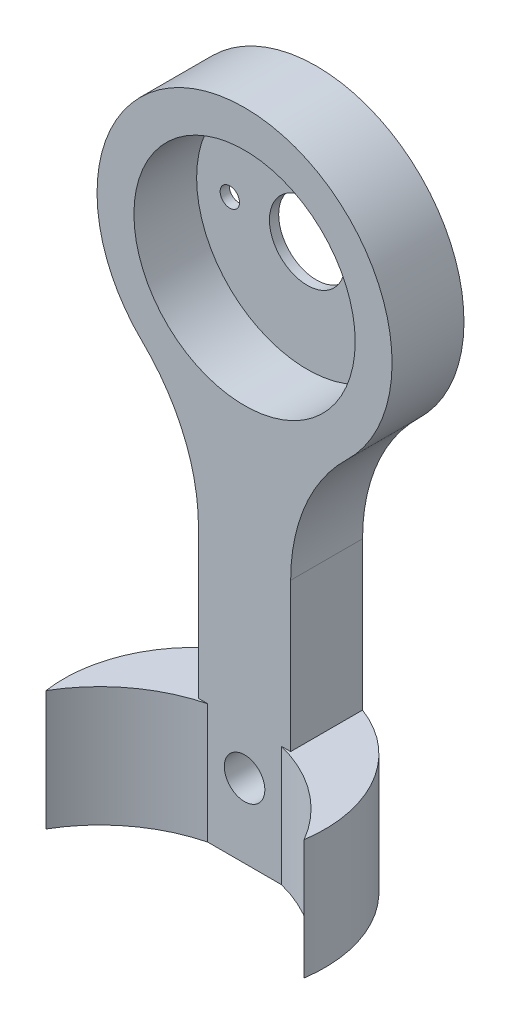
ISO-10303-21;
HEADER;
FILE_DESCRIPTION(('STEP AP214'),'2;1');
FILE_NAME('part.step','',(''),(''),'','','');
FILE_SCHEMA(('AUTOMOTIVE_DESIGN { 1 0 10303 214 1 1 1 1 }'));
ENDSEC;
DATA;
#1=APPLICATION_CONTEXT('core data for automotive mechanical design processes');
#2=APPLICATION_PROTOCOL_DEFINITION('international standard','automotive_design',2000,#1);
#3=PRODUCT_CONTEXT('',#1,'mechanical');
#4=PRODUCT('Part','Part','',(#3));
#5=PRODUCT_RELATED_PRODUCT_CATEGORY('part','',(#4));
#6=PRODUCT_DEFINITION_FORMATION('','',#4);
#7=PRODUCT_DEFINITION_CONTEXT('part definition',#1,'design');
#8=PRODUCT_DEFINITION('design','',#6,#7);
#9=PRODUCT_DEFINITION_SHAPE('','',#8);
#10=(LENGTH_UNIT() NAMED_UNIT(*) SI_UNIT(.MILLI.,.METRE.));
#11=(NAMED_UNIT(*) PLANE_ANGLE_UNIT() SI_UNIT($,.RADIAN.));
#12=(NAMED_UNIT(*) SI_UNIT($,.STERADIAN.) SOLID_ANGLE_UNIT());
#13=UNCERTAINTY_MEASURE_WITH_UNIT(LENGTH_MEASURE(1.E-05),#10,'distance_accuracy_value','');
#14=(GEOMETRIC_REPRESENTATION_CONTEXT(3) GLOBAL_UNCERTAINTY_ASSIGNED_CONTEXT((#13)) GLOBAL_UNIT_ASSIGNED_CONTEXT((#10,
#11,#12)) REPRESENTATION_CONTEXT('',''));
#15=CARTESIAN_POINT('',(0.,0.,0.));
#16=DIRECTION('',(0.,0.,1.));
#17=DIRECTION('',(1.,0.,0.));
#18=AXIS2_PLACEMENT_3D('',#15,#16,#17);
#19=CARTESIAN_POINT('',(12.5,-12.9518338469886,3.9));
#20=DIRECTION('',(0.,0.,1.));
#21=DIRECTION('',(1.,0.,0.));
#22=AXIS2_PLACEMENT_3D('',#19,#20,#21);
#23=PLANE('',#22);
#24=DIRECTION('',(-1.,0.,0.));
#25=VECTOR('',#24,1.);
#26=CARTESIAN_POINT('',(0.,-21.0000000000125,3.9));
#27=LINE('',#26,#25);
#28=CARTESIAN_POINT('',(-1.99783536705259,-21.0000000000125,3.9));
#29=VERTEX_POINT('',#28);
#30=CARTESIAN_POINT('',(-2.5,-21.0000000000125,3.9));
#31=VERTEX_POINT('',#30);
#32=EDGE_CURVE('E54',#29,#31,#27,.T.);
#33=ORIENTED_EDGE('',*,*,#32,.F.);
#34=DIRECTION('',(0.,-1.,0.));
#35=VECTOR('',#34,1.);
#36=CARTESIAN_POINT('',(-1.9978353670526,-11.8029554694924,3.9));
#37=LINE('',#36,#35);
#38=CARTESIAN_POINT('',(-1.9978353670526,-27.5,3.9));
#39=VERTEX_POINT('',#38);
#40=EDGE_CURVE('E139',#29,#39,#37,.T.);
#41=ORIENTED_EDGE('',*,*,#40,.T.);
#42=DIRECTION('',(1.,0.,0.));
#43=VECTOR('',#42,1.);
#44=CARTESIAN_POINT('',(-2.5,-27.5,3.9));
#45=LINE('',#44,#43);
#46=CARTESIAN_POINT('',(1.99783536705259,-27.5,3.9));
#47=VERTEX_POINT('',#46);
#48=EDGE_CURVE('E124',#39,#47,#45,.T.);
#49=ORIENTED_EDGE('',*,*,#48,.T.);
#50=DIRECTION('',(0.,-1.,0.));
#51=VECTOR('',#50,1.);
#52=CARTESIAN_POINT('',(1.99783536705259,-11.8029554694924,3.9));
#53=LINE('',#52,#51);
#54=CARTESIAN_POINT('',(1.99783536705259,-21.0000000000125,3.9));
#55=VERTEX_POINT('',#54);
#56=EDGE_CURVE('E167',#55,#47,#53,.T.);
#57=ORIENTED_EDGE('',*,*,#56,.F.);
#58=DIRECTION('',(-1.,0.,0.));
#59=VECTOR('',#58,1.);
#60=CARTESIAN_POINT('',(0.,-21.0000000000125,3.9));
#61=LINE('',#60,#59);
#62=CARTESIAN_POINT('',(2.5,-21.0000000000125,3.9));
#63=VERTEX_POINT('',#62);
#64=EDGE_CURVE('E169',#63,#55,#61,.T.);
#65=ORIENTED_EDGE('',*,*,#64,.F.);
#66=DIRECTION('',(0.,1.,0.));
#67=VECTOR('',#66,1.);
#68=CARTESIAN_POINT('',(2.5,-12.9518338469886,3.9));
#69=LINE('',#68,#67);
#70=CARTESIAN_POINT('',(2.5,-12.9518338469886,3.9));
#71=VERTEX_POINT('',#70);
#72=EDGE_CURVE('E135',#63,#71,#69,.T.);
#73=ORIENTED_EDGE('',*,*,#72,.T.);
#74=CARTESIAN_POINT('',(12.5,-12.9518338469886,3.9));
#75=DIRECTION('',(0.,0.,-1.));
#76=DIRECTION('',(1.,0.,0.));
#77=AXIS2_PLACEMENT_3D('',#74,#75,#76);
#78=CIRCLE('',#77,10.);
#79=CARTESIAN_POINT('',(5.55555555555555,-5.75637059866161,3.9));
#80=VERTEX_POINT('',#79);
#81=EDGE_CURVE('E207',#71,#80,#78,.T.);
#82=ORIENTED_EDGE('',*,*,#81,.T.);
#83=CARTESIAN_POINT('',(0.,0.,3.9));
#84=DIRECTION('',(0.,0.,1.));
#85=DIRECTION('',(1.,0.,0.));
#86=AXIS2_PLACEMENT_3D('',#83,#84,#85);
#87=CIRCLE('',#86,8.);
#88=CARTESIAN_POINT('',(-5.55555555555556,-5.7563705986616,3.9));
#89=VERTEX_POINT('',#88);
#90=EDGE_CURVE('E210',#80,#89,#87,.T.);
#91=ORIENTED_EDGE('',*,*,#90,.T.);
#92=CARTESIAN_POINT('',(-12.5,-12.9518338469886,3.9));
#93=DIRECTION('',(0.,0.,-1.));
#94=DIRECTION('',(-1.,0.,0.));
#95=AXIS2_PLACEMENT_3D('',#92,#93,#94);
#96=CIRCLE('',#95,10.);
#97=CARTESIAN_POINT('',(-2.5,-12.9518338469886,3.9));
#98=VERTEX_POINT('',#97);
#99=EDGE_CURVE('E213',#89,#98,#96,.T.);
#100=ORIENTED_EDGE('',*,*,#99,.T.);
#101=DIRECTION('',(0.,-1.,0.));
#102=VECTOR('',#101,1.);
#103=CARTESIAN_POINT('',(-2.5,-12.9518338469886,3.9));
#104=LINE('',#103,#102);
#105=EDGE_CURVE('E136',#98,#31,#104,.T.);
#106=ORIENTED_EDGE('',*,*,#105,.T.);
#107=EDGE_LOOP('',(#33,#41,#49,#57,#65,#73,#82,#91,#100,#106));
#108=FACE_BOUND('',#107,.T.);
#109=CARTESIAN_POINT('',(0.,0.,3.9));
#110=DIRECTION('',(0.,0.,1.));
#111=DIRECTION('',(1.,0.,0.));
#112=AXIS2_PLACEMENT_3D('',#109,#110,#111);
#113=CIRCLE('',#112,6.);
#114=CARTESIAN_POINT('',(6.,0.,3.9));
#115=VERTEX_POINT('',#114);
#116=EDGE_CURVE('E200',#115,#115,#113,.T.);
#117=ORIENTED_EDGE('',*,*,#116,.F.);
#118=EDGE_LOOP('',(#117));
#119=FACE_BOUND('',#118,.T.);
#120=CARTESIAN_POINT('',(0.,-23.5,3.9));
#121=DIRECTION('',(0.,0.,1.));
#122=DIRECTION('',(1.,0.,0.));
#123=AXIS2_PLACEMENT_3D('',#120,#121,#122);
#124=CIRCLE('',#123,1.1);
#125=CARTESIAN_POINT('',(1.1,-23.5,3.9));
#126=VERTEX_POINT('',#125);
#127=EDGE_CURVE('E197',#126,#126,#124,.T.);
#128=ORIENTED_EDGE('',*,*,#127,.F.);
#129=EDGE_LOOP('',(#128));
#130=FACE_BOUND('',#129,.T.);
#131=ADVANCED_FACE('F38',(#108,#119,#130),#23,.T.);
#132=CARTESIAN_POINT('',(0.,0.,3.9));
#133=DIRECTION('',(0.,0.,-1.));
#134=DIRECTION('',(-1.,0.,0.));
#135=AXIS2_PLACEMENT_3D('',#132,#133,#134);
#136=CYLINDRICAL_SURFACE('',#135,6.);
#137=ORIENTED_EDGE('',*,*,#116,.T.);
#138=EDGE_LOOP('',(#137));
#139=FACE_BOUND('',#138,.T.);
#140=CARTESIAN_POINT('',(0.,0.,0.5));
#141=DIRECTION('',(0.,0.,-1.));
#142=DIRECTION('',(-1.,0.,0.));
#143=AXIS2_PLACEMENT_3D('',#140,#141,#142);
#144=CIRCLE('',#143,6.);
#145=CARTESIAN_POINT('',(-6.,0.,0.5));
#146=VERTEX_POINT('',#145);
#147=EDGE_CURVE('E42',#146,#146,#144,.T.);
#148=ORIENTED_EDGE('',*,*,#147,.T.);
#149=EDGE_LOOP('',(#148));
#150=FACE_BOUND('',#149,.T.);
#151=ADVANCED_FACE('F284',(#139,#150),#136,.F.);
#152=CARTESIAN_POINT('',(12.5,-12.9518338469886,0.));
#153=DIRECTION('',(0.,0.,1.));
#154=DIRECTION('',(1.,0.,0.));
#155=AXIS2_PLACEMENT_3D('',#152,#153,#154);
#156=PLANE('',#155);
#157=CARTESIAN_POINT('',(-12.5,-12.9518338469886,0.));
#158=DIRECTION('',(0.,0.,-1.));
#159=DIRECTION('',(-1.,0.,0.));
#160=AXIS2_PLACEMENT_3D('',#157,#158,#159);
#161=CIRCLE('',#160,10.);
#162=CARTESIAN_POINT('',(-5.55555555555556,-5.7563705986616,0.));
#163=VERTEX_POINT('',#162);
#164=CARTESIAN_POINT('',(-2.5,-12.9518338469886,0.));
#165=VERTEX_POINT('',#164);
#166=EDGE_CURVE('E223',#163,#165,#161,.T.);
#167=ORIENTED_EDGE('',*,*,#166,.F.);
#168=CARTESIAN_POINT('',(0.,0.,0.));
#169=DIRECTION('',(0.,0.,1.));
#170=DIRECTION('',(1.,0.,0.));
#171=AXIS2_PLACEMENT_3D('',#168,#169,#170);
#172=CIRCLE('',#171,8.);
#173=CARTESIAN_POINT('',(5.55555555555555,-5.75637059866161,0.));
#174=VERTEX_POINT('',#173);
#175=EDGE_CURVE('E220',#174,#163,#172,.T.);
#176=ORIENTED_EDGE('',*,*,#175,.F.);
#177=CARTESIAN_POINT('',(12.5,-12.9518338469886,0.));
#178=DIRECTION('',(0.,0.,-1.));
#179=DIRECTION('',(1.,0.,0.));
#180=AXIS2_PLACEMENT_3D('',#177,#178,#179);
#181=CIRCLE('',#180,10.);
#182=CARTESIAN_POINT('',(2.5,-12.9518338469886,0.));
#183=VERTEX_POINT('',#182);
#184=EDGE_CURVE('E206',#183,#174,#181,.T.);
#185=ORIENTED_EDGE('',*,*,#184,.F.);
#186=DIRECTION('',(0.,1.,0.));
#187=VECTOR('',#186,1.);
#188=CARTESIAN_POINT('',(2.5,-12.9518338469886,0.));
#189=LINE('',#188,#187);
#190=CARTESIAN_POINT('',(2.5,-21.0000000000125,0.));
#191=VERTEX_POINT('',#190);
#192=EDGE_CURVE('E230',#191,#183,#189,.T.);
#193=ORIENTED_EDGE('',*,*,#192,.F.);
#194=CARTESIAN_POINT('',(2.5,-27.5,0.));
#195=VERTEX_POINT('',#194);
#196=EDGE_CURVE('E211',#195,#191,#189,.T.);
#197=ORIENTED_EDGE('',*,*,#196,.F.);
#198=DIRECTION('',(1.,0.,0.));
#199=VECTOR('',#198,1.);
#200=CARTESIAN_POINT('',(-2.5,-27.5,0.));
#201=LINE('',#200,#199);
#202=CARTESIAN_POINT('',(-2.5,-27.5,0.));
#203=VERTEX_POINT('',#202);
#204=EDGE_CURVE('E227',#203,#195,#201,.T.);
#205=ORIENTED_EDGE('',*,*,#204,.F.);
#206=DIRECTION('',(0.,-1.,0.));
#207=VECTOR('',#206,1.);
#208=CARTESIAN_POINT('',(-2.5,-11.8029554694924,0.));
#209=LINE('',#208,#207);
#210=CARTESIAN_POINT('',(-2.5,-21.0000000000125,0.));
#211=VERTEX_POINT('',#210);
#212=EDGE_CURVE('E144',#211,#203,#209,.T.);
#213=ORIENTED_EDGE('',*,*,#212,.F.);
#214=DIRECTION('',(0.,-1.,0.));
#215=VECTOR('',#214,1.);
#216=CARTESIAN_POINT('',(-2.5,-12.9518338469886,0.));
#217=LINE('',#216,#215);
#218=EDGE_CURVE('E225',#165,#211,#217,.T.);
#219=ORIENTED_EDGE('',*,*,#218,.F.);
#220=EDGE_LOOP('',(#167,#176,#185,#193,#197,#205,#213,#219));
#221=FACE_BOUND('',#220,.T.);
#222=CARTESIAN_POINT('',(0.,-23.5,0.));
#223=DIRECTION('',(0.,0.,1.));
#224=DIRECTION('',(1.,0.,0.));
#225=AXIS2_PLACEMENT_3D('',#222,#223,#224);
#226=CIRCLE('',#225,1.1);
#227=CARTESIAN_POINT('',(1.1,-23.5,0.));
#228=VERTEX_POINT('',#227);
#229=EDGE_CURVE('E201',#228,#228,#226,.T.);
#230=ORIENTED_EDGE('',*,*,#229,.T.);
#231=EDGE_LOOP('',(#230));
#232=FACE_BOUND('',#231,.T.);
#233=CARTESIAN_POINT('',(0.,0.,0.));
#234=DIRECTION('',(0.,0.,-1.));
#235=DIRECTION('',(-1.,0.,0.));
#236=AXIS2_PLACEMENT_3D('',#233,#234,#235);
#237=CIRCLE('',#236,2.05);
#238=CARTESIAN_POINT('',(-2.05,0.,0.));
#239=VERTEX_POINT('',#238);
#240=EDGE_CURVE('E189',#239,#239,#237,.T.);
#241=ORIENTED_EDGE('',*,*,#240,.F.);
#242=EDGE_LOOP('',(#241));
#243=FACE_BOUND('',#242,.T.);
#244=CARTESIAN_POINT('',(-4.2,0.,0.));
#245=DIRECTION('',(0.,0.,-1.));
#246=DIRECTION('',(-1.,0.,0.));
#247=AXIS2_PLACEMENT_3D('',#244,#245,#246);
#248=CIRCLE('',#247,0.525);
#249=CARTESIAN_POINT('',(-4.725,0.,0.));
#250=VERTEX_POINT('',#249);
#251=EDGE_CURVE('E183',#250,#250,#248,.T.);
#252=ORIENTED_EDGE('',*,*,#251,.F.);
#253=EDGE_LOOP('',(#252));
#254=FACE_BOUND('',#253,.T.);
#255=CARTESIAN_POINT('',(4.2,0.,0.));
#256=DIRECTION('',(0.,0.,-1.));
#257=DIRECTION('',(-1.,0.,0.));
#258=AXIS2_PLACEMENT_3D('',#255,#256,#257);
#259=CIRCLE('',#258,0.525);
#260=CARTESIAN_POINT('',(3.675,0.,0.));
#261=VERTEX_POINT('',#260);
#262=EDGE_CURVE('E172',#261,#261,#259,.T.);
#263=ORIENTED_EDGE('',*,*,#262,.F.);
#264=EDGE_LOOP('',(#263));
#265=FACE_BOUND('',#264,.T.);
#266=ADVANCED_FACE('F251',(#221,#232,#243,#254,#265),#156,.F.);
#267=CARTESIAN_POINT('',(12.5,-12.9518338469886,3.9));
#268=DIRECTION('',(0.,0.,-1.));
#269=DIRECTION('',(-1.,0.,0.));
#270=AXIS2_PLACEMENT_3D('',#267,#268,#269);
#271=CYLINDRICAL_SURFACE('',#270,10.);
#272=ORIENTED_EDGE('',*,*,#184,.T.);
#273=DIRECTION('',(0.,0.,-1.));
#274=VECTOR('',#273,1.);
#275=CARTESIAN_POINT('',(5.55555555555555,-5.75637059866161,3.9));
#276=LINE('',#275,#274);
#277=EDGE_CURVE('E11',#80,#174,#276,.T.);
#278=ORIENTED_EDGE('',*,*,#277,.F.);
#279=ORIENTED_EDGE('',*,*,#81,.F.);
#280=DIRECTION('',(0.,0.,-1.));
#281=VECTOR('',#280,1.);
#282=CARTESIAN_POINT('',(2.5,-12.9518338469886,3.9));
#283=LINE('',#282,#281);
#284=EDGE_CURVE('E217',#71,#183,#283,.T.);
#285=ORIENTED_EDGE('',*,*,#284,.T.);
#286=EDGE_LOOP('',(#272,#278,#279,#285));
#287=FACE_BOUND('',#286,.T.);
#288=ADVANCED_FACE('F40',(#287),#271,.F.);
#289=CARTESIAN_POINT('',(0.,0.,3.9));
#290=DIRECTION('',(0.,0.,-1.));
#291=DIRECTION('',(-1.,0.,0.));
#292=AXIS2_PLACEMENT_3D('',#289,#290,#291);
#293=CYLINDRICAL_SURFACE('',#292,8.);
#294=ORIENTED_EDGE('',*,*,#175,.T.);
#295=DIRECTION('',(0.,0.,-1.));
#296=VECTOR('',#295,1.);
#297=CARTESIAN_POINT('',(-5.55555555555556,-5.7563705986616,3.9));
#298=LINE('',#297,#296);
#299=EDGE_CURVE('E47',#89,#163,#298,.T.);
#300=ORIENTED_EDGE('',*,*,#299,.F.);
#301=ORIENTED_EDGE('',*,*,#90,.F.);
#302=ORIENTED_EDGE('',*,*,#277,.T.);
#303=EDGE_LOOP('',(#294,#300,#301,#302));
#304=FACE_BOUND('',#303,.T.);
#305=ADVANCED_FACE('F246',(#304),#293,.T.);
#306=CARTESIAN_POINT('',(-12.5,-12.9518338469886,3.9));
#307=DIRECTION('',(0.,0.,-1.));
#308=DIRECTION('',(-1.,0.,0.));
#309=AXIS2_PLACEMENT_3D('',#306,#307,#308);
#310=CYLINDRICAL_SURFACE('',#309,10.);
#311=ORIENTED_EDGE('',*,*,#166,.T.);
#312=DIRECTION('',(0.,0.,-1.));
#313=VECTOR('',#312,1.);
#314=CARTESIAN_POINT('',(-2.5,-12.9518338469886,3.9));
#315=LINE('',#314,#313);
#316=EDGE_CURVE('E235',#98,#165,#315,.T.);
#317=ORIENTED_EDGE('',*,*,#316,.F.);
#318=ORIENTED_EDGE('',*,*,#99,.F.);
#319=ORIENTED_EDGE('',*,*,#299,.T.);
#320=EDGE_LOOP('',(#311,#317,#318,#319));
#321=FACE_BOUND('',#320,.T.);
#322=ADVANCED_FACE('F241',(#321),#310,.F.);
#323=CARTESIAN_POINT('',(-2.5,-12.9518338469886,3.9));
#324=DIRECTION('',(1.,0.,0.));
#325=DIRECTION('',(0.,1.,0.));
#326=AXIS2_PLACEMENT_3D('',#323,#324,#325);
#327=PLANE('',#326);
#328=ORIENTED_EDGE('',*,*,#218,.T.);
#329=DIRECTION('',(0.,0.,-1.));
#330=VECTOR('',#329,1.);
#331=CARTESIAN_POINT('',(-2.5,-21.0000000000125,0.));
#332=LINE('',#331,#330);
#333=EDGE_CURVE('E62',#31,#211,#332,.T.);
#334=ORIENTED_EDGE('',*,*,#333,.F.);
#335=ORIENTED_EDGE('',*,*,#105,.F.);
#336=ORIENTED_EDGE('',*,*,#316,.T.);
#337=EDGE_LOOP('',(#328,#334,#335,#336));
#338=FACE_BOUND('',#337,.T.);
#339=ADVANCED_FACE('F253',(#338),#327,.F.);
#340=CARTESIAN_POINT('',(-2.5,-27.5,3.9));
#341=DIRECTION('',(0.,1.,0.));
#342=DIRECTION('',(0.,0.,1.));
#343=AXIS2_PLACEMENT_3D('',#340,#341,#342);
#344=PLANE('',#343);
#345=CARTESIAN_POINT('',(0.,-27.5,6.62140707977715));
#346=DIRECTION('',(0.,-1.,0.));
#347=DIRECTION('',(0.,0.,-1.));
#348=AXIS2_PLACEMENT_3D('',#345,#346,#347);
#349=CIRCLE('',#348,7.07764309047319);
#350=CARTESIAN_POINT('',(-7.,-27.5,7.6668886511704));
#351=VERTEX_POINT('',#350);
#352=EDGE_CURVE('E155',#351,#203,#349,.T.);
#353=ORIENTED_EDGE('',*,*,#352,.T.);
#354=ORIENTED_EDGE('',*,*,#204,.T.);
#355=CARTESIAN_POINT('',(0.,-27.5,6.62140707977715));
#356=DIRECTION('',(0.,-1.,0.));
#357=DIRECTION('',(0.,0.,-1.));
#358=AXIS2_PLACEMENT_3D('',#355,#356,#357);
#359=CIRCLE('',#358,7.07764309047319);
#360=CARTESIAN_POINT('',(7.,-27.5,7.6668886511704));
#361=VERTEX_POINT('',#360);
#362=EDGE_CURVE('E150',#361,#195,#359,.F.);
#363=ORIENTED_EDGE('',*,*,#362,.F.);
#364=CARTESIAN_POINT('',(0.,-27.5,11.7576923076923));
#365=DIRECTION('',(0.,-1.,0.));
#366=DIRECTION('',(0.,0.,-1.));
#367=AXIS2_PLACEMENT_3D('',#364,#365,#366);
#368=CIRCLE('',#367,8.10769230769231);
#369=EDGE_CURVE('E132',#47,#361,#368,.T.);
#370=ORIENTED_EDGE('',*,*,#369,.F.);
#371=ORIENTED_EDGE('',*,*,#48,.F.);
#372=CARTESIAN_POINT('',(0.,-27.5,11.7576923076923));
#373=DIRECTION('',(0.,-1.,0.));
#374=DIRECTION('',(0.,0.,-1.));
#375=AXIS2_PLACEMENT_3D('',#372,#373,#374);
#376=CIRCLE('',#375,8.10769230769231);
#377=EDGE_CURVE('E128',#351,#39,#376,.T.);
#378=ORIENTED_EDGE('',*,*,#377,.F.);
#379=EDGE_LOOP('',(#353,#354,#363,#370,#371,#378));
#380=FACE_BOUND('',#379,.T.);
#381=ADVANCED_FACE('F126',(#380),#344,.F.);
#382=CARTESIAN_POINT('',(2.5,-12.9518338469886,3.9));
#383=DIRECTION('',(-1.,0.,0.));
#384=DIRECTION('',(0.,-1.,0.));
#385=AXIS2_PLACEMENT_3D('',#382,#383,#384);
#386=PLANE('',#385);
#387=ORIENTED_EDGE('',*,*,#72,.F.);
#388=DIRECTION('',(0.,0.,1.));
#389=VECTOR('',#388,1.);
#390=CARTESIAN_POINT('',(2.5,-21.0000000000125,0.));
#391=LINE('',#390,#389);
#392=EDGE_CURVE('E173',#191,#63,#391,.T.);
#393=ORIENTED_EDGE('',*,*,#392,.F.);
#394=ORIENTED_EDGE('',*,*,#192,.T.);
#395=ORIENTED_EDGE('',*,*,#284,.F.);
#396=EDGE_LOOP('',(#387,#393,#394,#395));
#397=FACE_BOUND('',#396,.T.);
#398=ADVANCED_FACE('F266',(#397),#386,.F.);
#399=CARTESIAN_POINT('',(0.,-23.5,3.9));
#400=DIRECTION('',(0.,0.,-1.));
#401=DIRECTION('',(-1.,0.,0.));
#402=AXIS2_PLACEMENT_3D('',#399,#400,#401);
#403=CYLINDRICAL_SURFACE('',#402,1.1);
#404=ORIENTED_EDGE('',*,*,#127,.T.);
#405=EDGE_LOOP('',(#404));
#406=FACE_BOUND('',#405,.T.);
#407=ORIENTED_EDGE('',*,*,#229,.F.);
#408=EDGE_LOOP('',(#407));
#409=FACE_BOUND('',#408,.T.);
#410=ADVANCED_FACE('F297',(#406,#409),#403,.F.);
#411=CARTESIAN_POINT('',(0.,0.,0.5));
#412=DIRECTION('',(0.,0.,-1.));
#413=DIRECTION('',(-1.,0.,0.));
#414=AXIS2_PLACEMENT_3D('',#411,#412,#413);
#415=PLANE('',#414);
#416=CARTESIAN_POINT('',(0.,0.,0.5));
#417=DIRECTION('',(0.,0.,-1.));
#418=DIRECTION('',(-1.,0.,0.));
#419=AXIS2_PLACEMENT_3D('',#416,#417,#418);
#420=CIRCLE('',#419,2.05);
#421=CARTESIAN_POINT('',(-2.05,0.,0.5));
#422=VERTEX_POINT('',#421);
#423=EDGE_CURVE('E192',#422,#422,#420,.T.);
#424=ORIENTED_EDGE('',*,*,#423,.T.);
#425=EDGE_LOOP('',(#424));
#426=FACE_BOUND('',#425,.T.);
#427=CARTESIAN_POINT('',(-4.2,0.,0.5));
#428=DIRECTION('',(0.,0.,-1.));
#429=DIRECTION('',(-1.,0.,0.));
#430=AXIS2_PLACEMENT_3D('',#427,#428,#429);
#431=CIRCLE('',#430,0.525);
#432=CARTESIAN_POINT('',(-4.725,0.,0.5));
#433=VERTEX_POINT('',#432);
#434=EDGE_CURVE('E186',#433,#433,#431,.T.);
#435=ORIENTED_EDGE('',*,*,#434,.T.);
#436=EDGE_LOOP('',(#435));
#437=FACE_BOUND('',#436,.T.);
#438=CARTESIAN_POINT('',(4.2,0.,0.5));
#439=DIRECTION('',(0.,0.,-1.));
#440=DIRECTION('',(-1.,0.,0.));
#441=AXIS2_PLACEMENT_3D('',#438,#439,#440);
#442=CIRCLE('',#441,0.525);
#443=CARTESIAN_POINT('',(3.675,0.,0.5));
#444=VERTEX_POINT('',#443);
#445=EDGE_CURVE('E180',#444,#444,#442,.T.);
#446=ORIENTED_EDGE('',*,*,#445,.T.);
#447=EDGE_LOOP('',(#446));
#448=FACE_BOUND('',#447,.T.);
#449=ORIENTED_EDGE('',*,*,#147,.F.);
#450=EDGE_LOOP('',(#449));
#451=FACE_BOUND('',#450,.T.);
#452=ADVANCED_FACE('F328',(#426,#437,#448,#451),#415,.F.);
#453=CARTESIAN_POINT('',(0.,0.,0.5));
#454=DIRECTION('',(0.,0.,-1.));
#455=DIRECTION('',(-1.,0.,0.));
#456=AXIS2_PLACEMENT_3D('',#453,#454,#455);
#457=CYLINDRICAL_SURFACE('',#456,2.05);
#458=ORIENTED_EDGE('',*,*,#423,.F.);
#459=EDGE_LOOP('',(#458));
#460=FACE_BOUND('',#459,.T.);
#461=ORIENTED_EDGE('',*,*,#240,.T.);
#462=EDGE_LOOP('',(#461));
#463=FACE_BOUND('',#462,.T.);
#464=ADVANCED_FACE('F340',(#460,#463),#457,.F.);
#465=CARTESIAN_POINT('',(-4.2,0.,0.5));
#466=DIRECTION('',(0.,0.,-1.));
#467=DIRECTION('',(-1.,0.,0.));
#468=AXIS2_PLACEMENT_3D('',#465,#466,#467);
#469=CYLINDRICAL_SURFACE('',#468,0.525);
#470=ORIENTED_EDGE('',*,*,#434,.F.);
#471=EDGE_LOOP('',(#470));
#472=FACE_BOUND('',#471,.T.);
#473=ORIENTED_EDGE('',*,*,#251,.T.);
#474=EDGE_LOOP('',(#473));
#475=FACE_BOUND('',#474,.T.);
#476=ADVANCED_FACE('F349',(#472,#475),#469,.F.);
#477=CARTESIAN_POINT('',(4.2,0.,0.5));
#478=DIRECTION('',(0.,0.,-1.));
#479=DIRECTION('',(-1.,0.,0.));
#480=AXIS2_PLACEMENT_3D('',#477,#478,#479);
#481=CYLINDRICAL_SURFACE('',#480,0.525);
#482=ORIENTED_EDGE('',*,*,#445,.F.);
#483=EDGE_LOOP('',(#482));
#484=FACE_BOUND('',#483,.T.);
#485=ORIENTED_EDGE('',*,*,#262,.T.);
#486=EDGE_LOOP('',(#485));
#487=FACE_BOUND('',#486,.T.);
#488=ADVANCED_FACE('F280',(#484,#487),#481,.F.);
#489=CARTESIAN_POINT('',(0.,-11.8029554694924,6.62140707977715));
#490=DIRECTION('',(0.,-1.,0.));
#491=DIRECTION('',(0.,0.,-1.));
#492=AXIS2_PLACEMENT_3D('',#489,#490,#491);
#493=CYLINDRICAL_SURFACE('',#492,7.07764309047319);
#494=CARTESIAN_POINT('',(0.,-21.0000000000125,6.62140707977715));
#495=DIRECTION('',(0.,1.,0.));
#496=DIRECTION('',(-1.,0.,0.));
#497=AXIS2_PLACEMENT_3D('',#494,#495,#496);
#498=CIRCLE('',#497,7.07764309047319);
#499=CARTESIAN_POINT('',(7.,-21.0000000000125,7.6668886511704));
#500=VERTEX_POINT('',#499);
#501=EDGE_CURVE('E175',#500,#191,#498,.T.);
#502=ORIENTED_EDGE('',*,*,#501,.F.);
#503=DIRECTION('',(0.,-1.,0.));
#504=VECTOR('',#503,1.);
#505=CARTESIAN_POINT('',(7.,-11.8029554694924,7.6668886511704));
#506=LINE('',#505,#504);
#507=EDGE_CURVE('E148',#500,#361,#506,.T.);
#508=ORIENTED_EDGE('',*,*,#507,.T.);
#509=ORIENTED_EDGE('',*,*,#362,.T.);
#510=ORIENTED_EDGE('',*,*,#196,.T.);
#511=EDGE_LOOP('',(#502,#508,#509,#510));
#512=FACE_BOUND('',#511,.T.);
#513=ADVANCED_FACE('F263',(#512),#493,.T.);
#514=CARTESIAN_POINT('',(0.,-11.8029554694924,11.7576923076923));
#515=DIRECTION('',(0.,-1.,0.));
#516=DIRECTION('',(0.,0.,-1.));
#517=AXIS2_PLACEMENT_3D('',#514,#515,#516);
#518=CYLINDRICAL_SURFACE('',#517,8.10769230769231);
#519=CARTESIAN_POINT('',(0.,-21.0000000000125,11.7576923076923));
#520=DIRECTION('',(0.,1.,0.));
#521=DIRECTION('',(-1.,0.,0.));
#522=AXIS2_PLACEMENT_3D('',#519,#520,#521);
#523=CIRCLE('',#522,8.10769230769231);
#524=EDGE_CURVE('E166',#55,#500,#523,.F.);
#525=ORIENTED_EDGE('',*,*,#524,.F.);
#526=ORIENTED_EDGE('',*,*,#56,.T.);
#527=ORIENTED_EDGE('',*,*,#369,.T.);
#528=ORIENTED_EDGE('',*,*,#507,.F.);
#529=EDGE_LOOP('',(#525,#526,#527,#528));
#530=FACE_BOUND('',#529,.T.);
#531=ADVANCED_FACE('F272',(#530),#518,.F.);
#532=CARTESIAN_POINT('',(0.,-21.0000000000125,11.65));
#533=DIRECTION('',(0.,1.,0.));
#534=DIRECTION('',(1.,0.,0.));
#535=AXIS2_PLACEMENT_3D('',#532,#533,#534);
#536=PLANE('',#535);
#537=ORIENTED_EDGE('',*,*,#524,.T.);
#538=ORIENTED_EDGE('',*,*,#501,.T.);
#539=ORIENTED_EDGE('',*,*,#392,.T.);
#540=ORIENTED_EDGE('',*,*,#64,.T.);
#541=EDGE_LOOP('',(#537,#538,#539,#540));
#542=FACE_BOUND('',#541,.T.);
#543=ADVANCED_FACE('F270',(#542),#536,.T.);
#544=CARTESIAN_POINT('',(0.,-21.0000000000125,11.65));
#545=DIRECTION('',(0.,1.,0.));
#546=DIRECTION('',(1.,0.,0.));
#547=AXIS2_PLACEMENT_3D('',#544,#545,#546);
#548=PLANE('',#547);
#549=CARTESIAN_POINT('',(0.,-21.0000000000125,6.62140707977715));
#550=DIRECTION('',(0.,1.,0.));
#551=DIRECTION('',(-1.,0.,0.));
#552=AXIS2_PLACEMENT_3D('',#549,#550,#551);
#553=CIRCLE('',#552,7.07764309047319);
#554=CARTESIAN_POINT('',(-7.,-21.0000000000125,7.6668886511704));
#555=VERTEX_POINT('',#554);
#556=EDGE_CURVE('E156',#555,#211,#553,.F.);
#557=ORIENTED_EDGE('',*,*,#556,.F.);
#558=CARTESIAN_POINT('',(0.,-21.0000000000125,11.7576923076923));
#559=DIRECTION('',(0.,1.,0.));
#560=DIRECTION('',(-1.,0.,0.));
#561=AXIS2_PLACEMENT_3D('',#558,#559,#560);
#562=CIRCLE('',#561,8.10769230769231);
#563=EDGE_CURVE('E159',#555,#29,#562,.F.);
#564=ORIENTED_EDGE('',*,*,#563,.T.);
#565=ORIENTED_EDGE('',*,*,#32,.T.);
#566=ORIENTED_EDGE('',*,*,#333,.T.);
#567=EDGE_LOOP('',(#557,#564,#565,#566));
#568=FACE_BOUND('',#567,.T.);
#569=ADVANCED_FACE('F255',(#568),#548,.T.);
#570=CARTESIAN_POINT('',(0.,-11.8029554694924,6.62140707977715));
#571=DIRECTION('',(0.,-1.,0.));
#572=DIRECTION('',(0.,0.,-1.));
#573=AXIS2_PLACEMENT_3D('',#570,#571,#572);
#574=CYLINDRICAL_SURFACE('',#573,7.07764309047319);
#575=DIRECTION('',(0.,-1.,0.));
#576=VECTOR('',#575,1.);
#577=CARTESIAN_POINT('',(-7.,-11.8029554694924,7.6668886511704));
#578=LINE('',#577,#576);
#579=EDGE_CURVE('E143',#555,#351,#578,.T.);
#580=ORIENTED_EDGE('',*,*,#579,.F.);
#581=ORIENTED_EDGE('',*,*,#556,.T.);
#582=ORIENTED_EDGE('',*,*,#212,.T.);
#583=ORIENTED_EDGE('',*,*,#352,.F.);
#584=EDGE_LOOP('',(#580,#581,#582,#583));
#585=FACE_BOUND('',#584,.T.);
#586=ADVANCED_FACE('F257',(#585),#574,.T.);
#587=CARTESIAN_POINT('',(0.,-11.8029554694924,11.7576923076923));
#588=DIRECTION('',(0.,-1.,0.));
#589=DIRECTION('',(0.,0.,-1.));
#590=AXIS2_PLACEMENT_3D('',#587,#588,#589);
#591=CYLINDRICAL_SURFACE('',#590,8.10769230769231);
#592=ORIENTED_EDGE('',*,*,#563,.F.);
#593=ORIENTED_EDGE('',*,*,#579,.T.);
#594=ORIENTED_EDGE('',*,*,#377,.T.);
#595=ORIENTED_EDGE('',*,*,#40,.F.);
#596=EDGE_LOOP('',(#592,#593,#594,#595));
#597=FACE_BOUND('',#596,.T.);
#598=ADVANCED_FACE('F146',(#597),#591,.F.);
#599=CLOSED_SHELL('',(#131,#151,#266,#288,#305,#322,#339,#381,#398,#410,#452,#464,#476,#488,
#513,#531,#543,#569,#586,#598));
#600=MANIFOLD_SOLID_BREP('B2',#599);
#601=ADVANCED_BREP_SHAPE_REPRESENTATION('',(#18,#600),#14);
#602=SHAPE_DEFINITION_REPRESENTATION(#9,#601);
ENDSEC;
END-ISO-10303-21;
